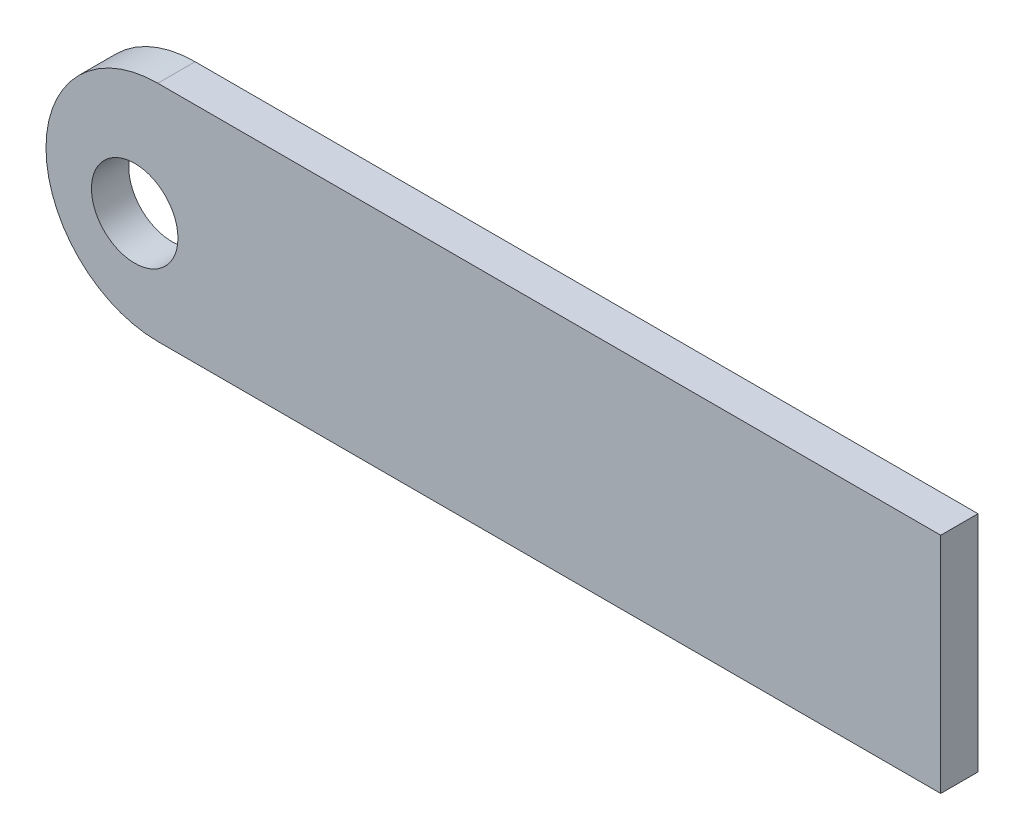
ISO-10303-21;
HEADER;
FILE_DESCRIPTION(('STEP AP214'),'2;1');
FILE_NAME('part.step','',(''),(''),'','','');
FILE_SCHEMA(('AUTOMOTIVE_DESIGN { 1 0 10303 214 1 1 1 1 }'));
ENDSEC;
DATA;
#1=APPLICATION_CONTEXT('core data for automotive mechanical design processes');
#2=APPLICATION_PROTOCOL_DEFINITION('international standard','automotive_design',2000,#1);
#3=PRODUCT_CONTEXT('',#1,'mechanical');
#4=PRODUCT('Part','Part','',(#3));
#5=PRODUCT_RELATED_PRODUCT_CATEGORY('part','',(#4));
#6=PRODUCT_DEFINITION_FORMATION('','',#4);
#7=PRODUCT_DEFINITION_CONTEXT('part definition',#1,'design');
#8=PRODUCT_DEFINITION('design','',#6,#7);
#9=PRODUCT_DEFINITION_SHAPE('','',#8);
#10=(LENGTH_UNIT() NAMED_UNIT(*) SI_UNIT(.MILLI.,.METRE.));
#11=(NAMED_UNIT(*) PLANE_ANGLE_UNIT() SI_UNIT($,.RADIAN.));
#12=(NAMED_UNIT(*) SI_UNIT($,.STERADIAN.) SOLID_ANGLE_UNIT());
#13=UNCERTAINTY_MEASURE_WITH_UNIT(LENGTH_MEASURE(1.E-05),#10,'distance_accuracy_value','');
#14=(GEOMETRIC_REPRESENTATION_CONTEXT(3) GLOBAL_UNCERTAINTY_ASSIGNED_CONTEXT((#13)) GLOBAL_UNIT_ASSIGNED_CONTEXT((#10,
#11,#12)) REPRESENTATION_CONTEXT('',''));
#15=CARTESIAN_POINT('',(0.,0.,0.));
#16=DIRECTION('',(0.,0.,1.));
#17=DIRECTION('',(1.,0.,0.));
#18=AXIS2_PLACEMENT_3D('',#15,#16,#17);
#19=CARTESIAN_POINT('',(0.,0.,3.175));
#20=DIRECTION('',(0.,1.,0.));
#21=DIRECTION('',(0.,0.,1.));
#22=AXIS2_PLACEMENT_3D('',#19,#20,#21);
#23=PLANE('',#22);
#24=DIRECTION('',(1.,0.,0.));
#25=VECTOR('',#24,1.);
#26=CARTESIAN_POINT('',(0.,0.,3.175));
#27=LINE('',#26,#25);
#28=CARTESIAN_POINT('',(9.525,0.,3.175));
#29=VERTEX_POINT('',#28);
#30=CARTESIAN_POINT('',(76.2,0.,3.175));
#31=VERTEX_POINT('',#30);
#32=EDGE_CURVE('E78',#29,#31,#27,.T.);
#33=ORIENTED_EDGE('',*,*,#32,.F.);
#34=DIRECTION('',(0.,0.,-1.));
#35=VECTOR('',#34,1.);
#36=CARTESIAN_POINT('',(9.525,0.,3.175));
#37=LINE('',#36,#35);
#38=CARTESIAN_POINT('',(9.525,0.,0.));
#39=VERTEX_POINT('',#38);
#40=EDGE_CURVE('E96',#29,#39,#37,.T.);
#41=ORIENTED_EDGE('',*,*,#40,.T.);
#42=DIRECTION('',(1.,0.,0.));
#43=VECTOR('',#42,1.);
#44=CARTESIAN_POINT('',(0.,0.,0.));
#45=LINE('',#44,#43);
#46=CARTESIAN_POINT('',(76.2,0.,0.));
#47=VERTEX_POINT('',#46);
#48=EDGE_CURVE('E93',#39,#47,#45,.T.);
#49=ORIENTED_EDGE('',*,*,#48,.T.);
#50=DIRECTION('',(0.,0.,-1.));
#51=VECTOR('',#50,1.);
#52=CARTESIAN_POINT('',(76.2,0.,3.175));
#53=LINE('',#52,#51);
#54=EDGE_CURVE('E91',#31,#47,#53,.T.);
#55=ORIENTED_EDGE('',*,*,#54,.F.);
#56=EDGE_LOOP('',(#33,#41,#49,#55));
#57=FACE_BOUND('',#56,.T.);
#58=ADVANCED_FACE('F32',(#57),#23,.F.);
#59=CARTESIAN_POINT('',(76.2,0.,3.175));
#60=DIRECTION('',(-1.,0.,0.));
#61=DIRECTION('',(0.,0.,1.));
#62=AXIS2_PLACEMENT_3D('',#59,#60,#61);
#63=PLANE('',#62);
#64=DIRECTION('',(0.,1.,0.));
#65=VECTOR('',#64,1.);
#66=CARTESIAN_POINT('',(76.2,0.,0.));
#67=LINE('',#66,#65);
#68=CARTESIAN_POINT('',(76.2,19.05,0.));
#69=VERTEX_POINT('',#68);
#70=EDGE_CURVE('E107',#47,#69,#67,.T.);
#71=ORIENTED_EDGE('',*,*,#70,.T.);
#72=DIRECTION('',(0.,0.,-1.));
#73=VECTOR('',#72,1.);
#74=CARTESIAN_POINT('',(76.2,19.05,3.175));
#75=LINE('',#74,#73);
#76=CARTESIAN_POINT('',(76.2,19.05,3.175));
#77=VERTEX_POINT('',#76);
#78=EDGE_CURVE('E97',#77,#69,#75,.T.);
#79=ORIENTED_EDGE('',*,*,#78,.F.);
#80=DIRECTION('',(0.,1.,0.));
#81=VECTOR('',#80,1.);
#82=CARTESIAN_POINT('',(76.2,0.,3.175));
#83=LINE('',#82,#81);
#84=EDGE_CURVE('E82',#31,#77,#83,.T.);
#85=ORIENTED_EDGE('',*,*,#84,.F.);
#86=ORIENTED_EDGE('',*,*,#54,.T.);
#87=EDGE_LOOP('',(#71,#79,#85,#86));
#88=FACE_BOUND('',#87,.T.);
#89=ADVANCED_FACE('F99',(#88),#63,.F.);
#90=CARTESIAN_POINT('',(0.,19.05,3.175));
#91=DIRECTION('',(0.,-1.,0.));
#92=DIRECTION('',(0.,0.,-1.));
#93=AXIS2_PLACEMENT_3D('',#90,#91,#92);
#94=PLANE('',#93);
#95=DIRECTION('',(-1.,0.,0.));
#96=VECTOR('',#95,1.);
#97=CARTESIAN_POINT('',(0.,19.05,0.));
#98=LINE('',#97,#96);
#99=CARTESIAN_POINT('',(9.525,19.05,0.));
#100=VERTEX_POINT('',#99);
#101=EDGE_CURVE('E88',#69,#100,#98,.T.);
#102=ORIENTED_EDGE('',*,*,#101,.T.);
#103=DIRECTION('',(0.,0.,-1.));
#104=VECTOR('',#103,1.);
#105=CARTESIAN_POINT('',(9.525,19.05,3.175));
#106=LINE('',#105,#104);
#107=CARTESIAN_POINT('',(9.525,19.05,3.175));
#108=VERTEX_POINT('',#107);
#109=EDGE_CURVE('E11',#100,#108,#106,.F.);
#110=ORIENTED_EDGE('',*,*,#109,.T.);
#111=DIRECTION('',(-1.,0.,0.));
#112=VECTOR('',#111,1.);
#113=CARTESIAN_POINT('',(0.,19.05,3.175));
#114=LINE('',#113,#112);
#115=EDGE_CURVE('E101',#77,#108,#114,.T.);
#116=ORIENTED_EDGE('',*,*,#115,.F.);
#117=ORIENTED_EDGE('',*,*,#78,.T.);
#118=EDGE_LOOP('',(#102,#110,#116,#117));
#119=FACE_BOUND('',#118,.T.);
#120=ADVANCED_FACE('F137',(#119),#94,.F.);
#121=CARTESIAN_POINT('',(0.,0.,3.175));
#122=DIRECTION('',(0.,0.,-1.));
#123=DIRECTION('',(-1.,0.,0.));
#124=AXIS2_PLACEMENT_3D('',#121,#122,#123);
#125=PLANE('',#124);
#126=CARTESIAN_POINT('',(7.55350619851142,8.47367626026641,3.175));
#127=DIRECTION('',(0.,0.,1.));
#128=DIRECTION('',(1.,0.,0.));
#129=AXIS2_PLACEMENT_3D('',#126,#127,#128);
#130=CIRCLE('',#129,3.68300000000001);
#131=CARTESIAN_POINT('',(11.2365061985114,8.47367626026641,3.175));
#132=VERTEX_POINT('',#131);
#133=EDGE_CURVE('E127',#132,#132,#130,.T.);
#134=ORIENTED_EDGE('',*,*,#133,.F.);
#135=EDGE_LOOP('',(#134));
#136=FACE_BOUND('',#135,.T.);
#137=CARTESIAN_POINT('',(9.525,9.525,3.175));
#138=DIRECTION('',(0.,0.,-1.));
#139=DIRECTION('',(-1.,0.,0.));
#140=AXIS2_PLACEMENT_3D('',#137,#138,#139);
#141=CIRCLE('',#140,9.525);
#142=CARTESIAN_POINT('',(0.,9.525,3.175));
#143=VERTEX_POINT('',#142);
#144=EDGE_CURVE('E53',#108,#143,#141,.F.);
#145=ORIENTED_EDGE('',*,*,#144,.T.);
#146=CARTESIAN_POINT('',(9.525,9.525,3.175));
#147=DIRECTION('',(0.,0.,-1.));
#148=DIRECTION('',(-1.,0.,0.));
#149=AXIS2_PLACEMENT_3D('',#146,#147,#148);
#150=CIRCLE('',#149,9.525);
#151=EDGE_CURVE('E41',#143,#29,#150,.F.);
#152=ORIENTED_EDGE('',*,*,#151,.T.);
#153=ORIENTED_EDGE('',*,*,#32,.T.);
#154=ORIENTED_EDGE('',*,*,#84,.T.);
#155=ORIENTED_EDGE('',*,*,#115,.T.);
#156=EDGE_LOOP('',(#145,#152,#153,#154,#155));
#157=FACE_BOUND('',#156,.T.);
#158=ADVANCED_FACE('F80',(#136,#157),#125,.F.);
#159=CARTESIAN_POINT('',(0.,0.,0.));
#160=DIRECTION('',(0.,0.,-1.));
#161=DIRECTION('',(-1.,0.,0.));
#162=AXIS2_PLACEMENT_3D('',#159,#160,#161);
#163=PLANE('',#162);
#164=CARTESIAN_POINT('',(7.55350619851142,8.47367626026641,0.));
#165=DIRECTION('',(0.,0.,1.));
#166=DIRECTION('',(1.,0.,0.));
#167=AXIS2_PLACEMENT_3D('',#164,#165,#166);
#168=CIRCLE('',#167,3.68300000000001);
#169=CARTESIAN_POINT('',(11.2365061985114,8.47367626026641,0.));
#170=VERTEX_POINT('',#169);
#171=EDGE_CURVE('E125',#170,#170,#168,.T.);
#172=ORIENTED_EDGE('',*,*,#171,.T.);
#173=EDGE_LOOP('',(#172));
#174=FACE_BOUND('',#173,.T.);
#175=ORIENTED_EDGE('',*,*,#48,.F.);
#176=CARTESIAN_POINT('',(9.525,9.525,0.));
#177=DIRECTION('',(0.,0.,-1.));
#178=DIRECTION('',(-1.,0.,0.));
#179=AXIS2_PLACEMENT_3D('',#176,#177,#178);
#180=CIRCLE('',#179,9.525);
#181=CARTESIAN_POINT('',(0.,9.525,0.));
#182=VERTEX_POINT('',#181);
#183=EDGE_CURVE('E114',#39,#182,#180,.T.);
#184=ORIENTED_EDGE('',*,*,#183,.T.);
#185=CARTESIAN_POINT('',(9.525,9.525,0.));
#186=DIRECTION('',(0.,0.,-1.));
#187=DIRECTION('',(-1.,0.,0.));
#188=AXIS2_PLACEMENT_3D('',#185,#186,#187);
#189=CIRCLE('',#188,9.525);
#190=EDGE_CURVE('E112',#182,#100,#189,.T.);
#191=ORIENTED_EDGE('',*,*,#190,.T.);
#192=ORIENTED_EDGE('',*,*,#101,.F.);
#193=ORIENTED_EDGE('',*,*,#70,.F.);
#194=EDGE_LOOP('',(#175,#184,#191,#192,#193));
#195=FACE_BOUND('',#194,.T.);
#196=ADVANCED_FACE('F119',(#174,#195),#163,.T.);
#197=CARTESIAN_POINT('',(9.525,9.525,3.175));
#198=DIRECTION('',(0.,0.,-1.));
#199=DIRECTION('',(-1.,0.,0.));
#200=AXIS2_PLACEMENT_3D('',#197,#198,#199);
#201=CYLINDRICAL_SURFACE('',#200,9.525);
#202=DIRECTION('',(0.,0.,-1.));
#203=VECTOR('',#202,1.);
#204=CARTESIAN_POINT('',(0.,9.525,3.175));
#205=LINE('',#204,#203);
#206=EDGE_CURVE('E36',#143,#182,#205,.T.);
#207=ORIENTED_EDGE('',*,*,#206,.F.);
#208=ORIENTED_EDGE('',*,*,#144,.F.);
#209=ORIENTED_EDGE('',*,*,#109,.F.);
#210=ORIENTED_EDGE('',*,*,#190,.F.);
#211=EDGE_LOOP('',(#207,#208,#209,#210));
#212=FACE_BOUND('',#211,.T.);
#213=ADVANCED_FACE('F34',(#212),#201,.T.);
#214=CARTESIAN_POINT('',(9.525,9.525,3.175));
#215=DIRECTION('',(0.,0.,-1.));
#216=DIRECTION('',(-1.,0.,0.));
#217=AXIS2_PLACEMENT_3D('',#214,#215,#216);
#218=CYLINDRICAL_SURFACE('',#217,9.525);
#219=ORIENTED_EDGE('',*,*,#151,.F.);
#220=ORIENTED_EDGE('',*,*,#206,.T.);
#221=ORIENTED_EDGE('',*,*,#183,.F.);
#222=ORIENTED_EDGE('',*,*,#40,.F.);
#223=EDGE_LOOP('',(#219,#220,#221,#222));
#224=FACE_BOUND('',#223,.T.);
#225=ADVANCED_FACE('F124',(#224),#218,.T.);
#226=CARTESIAN_POINT('',(7.55350619851142,8.47367626026641,0.));
#227=DIRECTION('',(0.,0.,1.));
#228=DIRECTION('',(1.,0.,0.));
#229=AXIS2_PLACEMENT_3D('',#226,#227,#228);
#230=CYLINDRICAL_SURFACE('',#229,3.68300000000001);
#231=ORIENTED_EDGE('',*,*,#171,.F.);
#232=EDGE_LOOP('',(#231));
#233=FACE_BOUND('',#232,.T.);
#234=ORIENTED_EDGE('',*,*,#133,.T.);
#235=EDGE_LOOP('',(#234));
#236=FACE_BOUND('',#235,.T.);
#237=ADVANCED_FACE('F134',(#233,#236),#230,.F.);
#238=CLOSED_SHELL('',(#58,#89,#120,#158,#196,#213,#225,#237));
#239=MANIFOLD_SOLID_BREP('B2',#238);
#240=ADVANCED_BREP_SHAPE_REPRESENTATION('',(#18,#239),#14);
#241=SHAPE_DEFINITION_REPRESENTATION(#9,#240);
ENDSEC;
END-ISO-10303-21;
